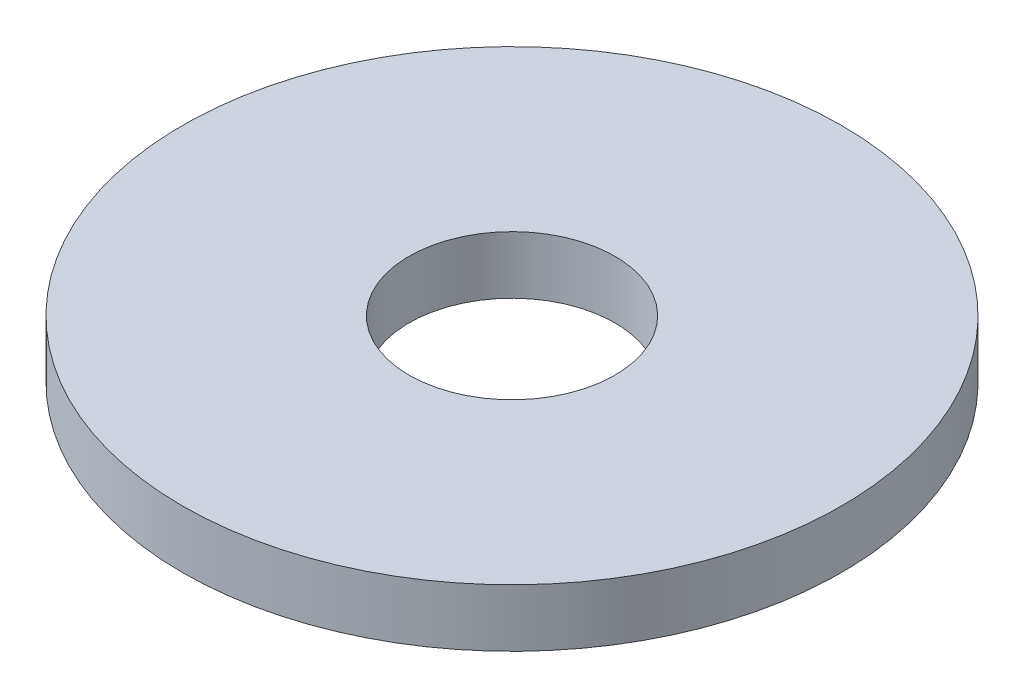
ISO-10303-21;
HEADER;
FILE_DESCRIPTION(('STEP AP214'),'2;1');
FILE_NAME('part.step','',(''),(''),'','','');
FILE_SCHEMA(('AUTOMOTIVE_DESIGN { 1 0 10303 214 1 1 1 1 }'));
ENDSEC;
DATA;
#1=APPLICATION_CONTEXT('core data for automotive mechanical design processes');
#2=APPLICATION_PROTOCOL_DEFINITION('international standard','automotive_design',2000,#1);
#3=PRODUCT_CONTEXT('',#1,'mechanical');
#4=PRODUCT('Part','Part','',(#3));
#5=PRODUCT_RELATED_PRODUCT_CATEGORY('part','',(#4));
#6=PRODUCT_DEFINITION_FORMATION('','',#4);
#7=PRODUCT_DEFINITION_CONTEXT('part definition',#1,'design');
#8=PRODUCT_DEFINITION('design','',#6,#7);
#9=PRODUCT_DEFINITION_SHAPE('','',#8);
#10=(LENGTH_UNIT() NAMED_UNIT(*) SI_UNIT(.MILLI.,.METRE.));
#11=(NAMED_UNIT(*) PLANE_ANGLE_UNIT() SI_UNIT($,.RADIAN.));
#12=(NAMED_UNIT(*) SI_UNIT($,.STERADIAN.) SOLID_ANGLE_UNIT());
#13=UNCERTAINTY_MEASURE_WITH_UNIT(LENGTH_MEASURE(1.E-05),#10,'distance_accuracy_value','');
#14=(GEOMETRIC_REPRESENTATION_CONTEXT(3) GLOBAL_UNCERTAINTY_ASSIGNED_CONTEXT((#13)) GLOBAL_UNIT_ASSIGNED_CONTEXT((#10,
#11,#12)) REPRESENTATION_CONTEXT('',''));
#15=CARTESIAN_POINT('',(0.,0.,0.));
#16=DIRECTION('',(0.,0.,1.));
#17=DIRECTION('',(1.,0.,0.));
#18=AXIS2_PLACEMENT_3D('',#15,#16,#17);
#19=CARTESIAN_POINT('',(0.,14.,0.));
#20=DIRECTION('',(0.,-1.,0.));
#21=DIRECTION('',(0.,0.,-1.));
#22=AXIS2_PLACEMENT_3D('',#19,#20,#21);
#23=CYLINDRICAL_SURFACE('',#22,80.);
#24=CARTESIAN_POINT('',(0.,14.,0.));
#25=DIRECTION('',(0.,1.,0.));
#26=DIRECTION('',(0.,0.,1.));
#27=AXIS2_PLACEMENT_3D('',#24,#25,#26);
#28=CIRCLE('',#27,80.);
#29=CARTESIAN_POINT('',(0.,14.,80.));
#30=VERTEX_POINT('',#29);
#31=EDGE_CURVE('E10',#30,#30,#28,.T.);
#32=ORIENTED_EDGE('',*,*,#31,.F.);
#33=EDGE_LOOP('',(#32));
#34=FACE_BOUND('',#33,.T.);
#35=CARTESIAN_POINT('',(0.,0.,0.));
#36=DIRECTION('',(0.,1.,0.));
#37=DIRECTION('',(0.,0.,1.));
#38=AXIS2_PLACEMENT_3D('',#35,#36,#37);
#39=CIRCLE('',#38,80.);
#40=CARTESIAN_POINT('',(0.,0.,80.));
#41=VERTEX_POINT('',#40);
#42=EDGE_CURVE('E37',#41,#41,#39,.T.);
#43=ORIENTED_EDGE('',*,*,#42,.T.);
#44=EDGE_LOOP('',(#43));
#45=FACE_BOUND('',#44,.T.);
#46=ADVANCED_FACE('F40',(#34,#45),#23,.T.);
#47=CARTESIAN_POINT('',(0.,14.,0.));
#48=DIRECTION('',(0.,1.,0.));
#49=DIRECTION('',(0.,0.,1.));
#50=AXIS2_PLACEMENT_3D('',#47,#48,#49);
#51=PLANE('',#50);
#52=CARTESIAN_POINT('',(0.,14.,0.));
#53=DIRECTION('',(0.,1.,0.));
#54=DIRECTION('',(0.,0.,1.));
#55=AXIS2_PLACEMENT_3D('',#52,#53,#54);
#56=CIRCLE('',#55,25.);
#57=CARTESIAN_POINT('',(0.,14.,25.));
#58=VERTEX_POINT('',#57);
#59=EDGE_CURVE('E50',#58,#58,#56,.T.);
#60=ORIENTED_EDGE('',*,*,#59,.F.);
#61=EDGE_LOOP('',(#60));
#62=FACE_BOUND('',#61,.T.);
#63=ORIENTED_EDGE('',*,*,#31,.T.);
#64=EDGE_LOOP('',(#63));
#65=FACE_BOUND('',#64,.T.);
#66=ADVANCED_FACE('F59',(#62,#65),#51,.T.);
#67=CARTESIAN_POINT('',(0.,0.,0.));
#68=DIRECTION('',(0.,1.,0.));
#69=DIRECTION('',(0.,0.,1.));
#70=AXIS2_PLACEMENT_3D('',#67,#68,#69);
#71=PLANE('',#70);
#72=CARTESIAN_POINT('',(0.,0.,0.));
#73=DIRECTION('',(0.,1.,0.));
#74=DIRECTION('',(0.,0.,1.));
#75=AXIS2_PLACEMENT_3D('',#72,#73,#74);
#76=CIRCLE('',#75,25.);
#77=CARTESIAN_POINT('',(0.,0.,25.));
#78=VERTEX_POINT('',#77);
#79=EDGE_CURVE('E47',#78,#78,#76,.T.);
#80=ORIENTED_EDGE('',*,*,#79,.T.);
#81=EDGE_LOOP('',(#80));
#82=FACE_BOUND('',#81,.T.);
#83=ORIENTED_EDGE('',*,*,#42,.F.);
#84=EDGE_LOOP('',(#83));
#85=FACE_BOUND('',#84,.T.);
#86=ADVANCED_FACE('F58',(#82,#85),#71,.F.);
#87=CARTESIAN_POINT('',(0.,14.,0.));
#88=DIRECTION('',(0.,-1.,0.));
#89=DIRECTION('',(0.,0.,-1.));
#90=AXIS2_PLACEMENT_3D('',#87,#88,#89);
#91=CYLINDRICAL_SURFACE('',#90,25.);
#92=ORIENTED_EDGE('',*,*,#59,.T.);
#93=EDGE_LOOP('',(#92));
#94=FACE_BOUND('',#93,.T.);
#95=ORIENTED_EDGE('',*,*,#79,.F.);
#96=EDGE_LOOP('',(#95));
#97=FACE_BOUND('',#96,.T.);
#98=ADVANCED_FACE('F54',(#94,#97),#91,.F.);
#99=CLOSED_SHELL('',(#46,#66,#86,#98));
#100=MANIFOLD_SOLID_BREP('B2',#99);
#101=ADVANCED_BREP_SHAPE_REPRESENTATION('',(#18,#100),#14);
#102=SHAPE_DEFINITION_REPRESENTATION(#9,#101);
ENDSEC;
END-ISO-10303-21;
